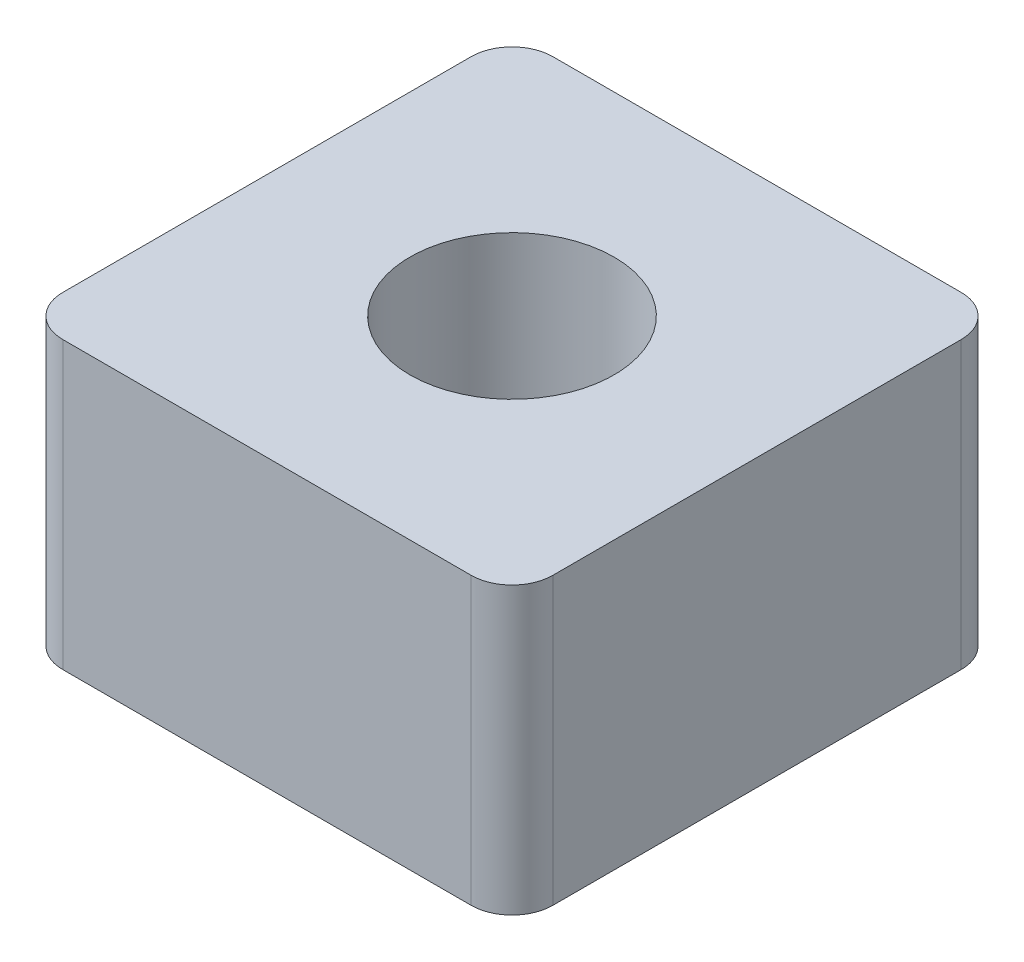
ISO-10303-21;
HEADER;
FILE_DESCRIPTION(('STEP AP214'),'2;1');
FILE_NAME('part.step','',(''),(''),'','','');
FILE_SCHEMA(('AUTOMOTIVE_DESIGN { 1 0 10303 214 1 1 1 1 }'));
ENDSEC;
DATA;
#1=APPLICATION_CONTEXT('core data for automotive mechanical design processes');
#2=APPLICATION_PROTOCOL_DEFINITION('international standard','automotive_design',2000,#1);
#3=PRODUCT_CONTEXT('',#1,'mechanical');
#4=PRODUCT('Part','Part','',(#3));
#5=PRODUCT_RELATED_PRODUCT_CATEGORY('part','',(#4));
#6=PRODUCT_DEFINITION_FORMATION('','',#4);
#7=PRODUCT_DEFINITION_CONTEXT('part definition',#1,'design');
#8=PRODUCT_DEFINITION('design','',#6,#7);
#9=PRODUCT_DEFINITION_SHAPE('','',#8);
#10=(LENGTH_UNIT() NAMED_UNIT(*) SI_UNIT(.MILLI.,.METRE.));
#11=(NAMED_UNIT(*) PLANE_ANGLE_UNIT() SI_UNIT($,.RADIAN.));
#12=(NAMED_UNIT(*) SI_UNIT($,.STERADIAN.) SOLID_ANGLE_UNIT());
#13=UNCERTAINTY_MEASURE_WITH_UNIT(LENGTH_MEASURE(1.E-05),#10,'distance_accuracy_value','');
#14=(GEOMETRIC_REPRESENTATION_CONTEXT(3) GLOBAL_UNCERTAINTY_ASSIGNED_CONTEXT((#13)) GLOBAL_UNIT_ASSIGNED_CONTEXT((#10,
#11,#12)) REPRESENTATION_CONTEXT('',''));
#15=CARTESIAN_POINT('',(0.,0.,0.));
#16=DIRECTION('',(0.,0.,1.));
#17=DIRECTION('',(1.,0.,0.));
#18=AXIS2_PLACEMENT_3D('',#15,#16,#17);
#19=CARTESIAN_POINT('',(-50.,70.,-50.));
#20=DIRECTION('',(0.,-1.,0.));
#21=DIRECTION('',(0.,0.,-1.));
#22=AXIS2_PLACEMENT_3D('',#19,#20,#21);
#23=CYLINDRICAL_SURFACE('',#22,10.);
#24=CARTESIAN_POINT('',(-50.,0.,-50.));
#25=DIRECTION('',(0.,-1.,0.));
#26=DIRECTION('',(0.,0.,-1.));
#27=AXIS2_PLACEMENT_3D('',#24,#25,#26);
#28=CIRCLE('',#27,10.);
#29=CARTESIAN_POINT('',(-60.,0.,-50.));
#30=VERTEX_POINT('',#29);
#31=CARTESIAN_POINT('',(-50.,0.,-60.));
#32=VERTEX_POINT('',#31);
#33=EDGE_CURVE('E131',#30,#32,#28,.T.);
#34=ORIENTED_EDGE('',*,*,#33,.F.);
#35=DIRECTION('',(0.,-1.,0.));
#36=VECTOR('',#35,1.);
#37=CARTESIAN_POINT('',(-60.,70.,-50.));
#38=LINE('',#37,#36);
#39=CARTESIAN_POINT('',(-60.,70.,-50.));
#40=VERTEX_POINT('',#39);
#41=EDGE_CURVE('E11',#40,#30,#38,.T.);
#42=ORIENTED_EDGE('',*,*,#41,.F.);
#43=CARTESIAN_POINT('',(-50.,70.,-50.));
#44=DIRECTION('',(0.,-1.,0.));
#45=DIRECTION('',(0.,0.,-1.));
#46=AXIS2_PLACEMENT_3D('',#43,#44,#45);
#47=CIRCLE('',#46,10.);
#48=CARTESIAN_POINT('',(-50.,70.,-60.));
#49=VERTEX_POINT('',#48);
#50=EDGE_CURVE('E150',#40,#49,#47,.T.);
#51=ORIENTED_EDGE('',*,*,#50,.T.);
#52=DIRECTION('',(0.,-1.,0.));
#53=VECTOR('',#52,1.);
#54=CARTESIAN_POINT('',(-50.,70.,-60.));
#55=LINE('',#54,#53);
#56=EDGE_CURVE('E40',#49,#32,#55,.T.);
#57=ORIENTED_EDGE('',*,*,#56,.T.);
#58=EDGE_LOOP('',(#34,#42,#51,#57));
#59=FACE_BOUND('',#58,.T.);
#60=ADVANCED_FACE('F37',(#59),#23,.T.);
#61=CARTESIAN_POINT('',(-60.,70.,50.));
#62=DIRECTION('',(-1.,0.,0.));
#63=DIRECTION('',(0.,0.,1.));
#64=AXIS2_PLACEMENT_3D('',#61,#62,#63);
#65=PLANE('',#64);
#66=DIRECTION('',(0.,0.,-1.));
#67=VECTOR('',#66,1.);
#68=CARTESIAN_POINT('',(-60.,0.,50.));
#69=LINE('',#68,#67);
#70=CARTESIAN_POINT('',(-60.,0.,50.));
#71=VERTEX_POINT('',#70);
#72=EDGE_CURVE('E148',#71,#30,#69,.T.);
#73=ORIENTED_EDGE('',*,*,#72,.F.);
#74=DIRECTION('',(0.,-1.,0.));
#75=VECTOR('',#74,1.);
#76=CARTESIAN_POINT('',(-60.,70.,50.));
#77=LINE('',#76,#75);
#78=CARTESIAN_POINT('',(-60.,70.,50.));
#79=VERTEX_POINT('',#78);
#80=EDGE_CURVE('E46',#79,#71,#77,.T.);
#81=ORIENTED_EDGE('',*,*,#80,.F.);
#82=DIRECTION('',(0.,0.,-1.));
#83=VECTOR('',#82,1.);
#84=CARTESIAN_POINT('',(-60.,70.,50.));
#85=LINE('',#84,#83);
#86=EDGE_CURVE('E126',#79,#40,#85,.T.);
#87=ORIENTED_EDGE('',*,*,#86,.T.);
#88=ORIENTED_EDGE('',*,*,#41,.T.);
#89=EDGE_LOOP('',(#73,#81,#87,#88));
#90=FACE_BOUND('',#89,.T.);
#91=ADVANCED_FACE('F165',(#90),#65,.T.);
#92=CARTESIAN_POINT('',(-50.,70.,50.));
#93=DIRECTION('',(0.,-1.,0.));
#94=DIRECTION('',(0.,0.,-1.));
#95=AXIS2_PLACEMENT_3D('',#92,#93,#94);
#96=CYLINDRICAL_SURFACE('',#95,10.);
#97=CARTESIAN_POINT('',(-50.,0.,50.));
#98=DIRECTION('',(0.,-1.,0.));
#99=DIRECTION('',(0.,0.,-1.));
#100=AXIS2_PLACEMENT_3D('',#97,#98,#99);
#101=CIRCLE('',#100,10.);
#102=CARTESIAN_POINT('',(-50.,0.,60.));
#103=VERTEX_POINT('',#102);
#104=EDGE_CURVE('E112',#103,#71,#101,.T.);
#105=ORIENTED_EDGE('',*,*,#104,.F.);
#106=DIRECTION('',(0.,-1.,0.));
#107=VECTOR('',#106,1.);
#108=CARTESIAN_POINT('',(-50.,70.,60.));
#109=LINE('',#108,#107);
#110=CARTESIAN_POINT('',(-50.,70.,60.));
#111=VERTEX_POINT('',#110);
#112=EDGE_CURVE('E106',#111,#103,#109,.T.);
#113=ORIENTED_EDGE('',*,*,#112,.F.);
#114=CARTESIAN_POINT('',(-50.,70.,50.));
#115=DIRECTION('',(0.,-1.,0.));
#116=DIRECTION('',(0.,0.,-1.));
#117=AXIS2_PLACEMENT_3D('',#114,#115,#116);
#118=CIRCLE('',#117,10.);
#119=EDGE_CURVE('E110',#111,#79,#118,.T.);
#120=ORIENTED_EDGE('',*,*,#119,.T.);
#121=ORIENTED_EDGE('',*,*,#80,.T.);
#122=EDGE_LOOP('',(#105,#113,#120,#121));
#123=FACE_BOUND('',#122,.T.);
#124=ADVANCED_FACE('F108',(#123),#96,.T.);
#125=CARTESIAN_POINT('',(-50.,70.,60.));
#126=DIRECTION('',(0.,0.,-1.));
#127=DIRECTION('',(-1.,0.,0.));
#128=AXIS2_PLACEMENT_3D('',#125,#126,#127);
#129=PLANE('',#128);
#130=DIRECTION('',(1.,0.,0.));
#131=VECTOR('',#130,1.);
#132=CARTESIAN_POINT('',(-50.,0.,60.));
#133=LINE('',#132,#131);
#134=CARTESIAN_POINT('',(50.,0.,60.));
#135=VERTEX_POINT('',#134);
#136=EDGE_CURVE('E145',#103,#135,#133,.T.);
#137=ORIENTED_EDGE('',*,*,#136,.T.);
#138=DIRECTION('',(0.,-1.,0.));
#139=VECTOR('',#138,1.);
#140=CARTESIAN_POINT('',(50.,70.,60.));
#141=LINE('',#140,#139);
#142=CARTESIAN_POINT('',(50.,70.,60.));
#143=VERTEX_POINT('',#142);
#144=EDGE_CURVE('E115',#143,#135,#141,.T.);
#145=ORIENTED_EDGE('',*,*,#144,.F.);
#146=DIRECTION('',(1.,0.,0.));
#147=VECTOR('',#146,1.);
#148=CARTESIAN_POINT('',(-50.,70.,60.));
#149=LINE('',#148,#147);
#150=EDGE_CURVE('E118',#111,#143,#149,.T.);
#151=ORIENTED_EDGE('',*,*,#150,.F.);
#152=ORIENTED_EDGE('',*,*,#112,.T.);
#153=EDGE_LOOP('',(#137,#145,#151,#152));
#154=FACE_BOUND('',#153,.T.);
#155=ADVANCED_FACE('F119',(#154),#129,.F.);
#156=CARTESIAN_POINT('',(50.,70.,50.));
#157=DIRECTION('',(0.,-1.,0.));
#158=DIRECTION('',(0.,0.,-1.));
#159=AXIS2_PLACEMENT_3D('',#156,#157,#158);
#160=CYLINDRICAL_SURFACE('',#159,10.);
#161=CARTESIAN_POINT('',(50.,0.,50.));
#162=DIRECTION('',(0.,1.,0.));
#163=DIRECTION('',(0.,0.,1.));
#164=AXIS2_PLACEMENT_3D('',#161,#162,#163);
#165=CIRCLE('',#164,10.);
#166=CARTESIAN_POINT('',(60.,0.,50.));
#167=VERTEX_POINT('',#166);
#168=EDGE_CURVE('E143',#135,#167,#165,.T.);
#169=ORIENTED_EDGE('',*,*,#168,.T.);
#170=DIRECTION('',(0.,-1.,0.));
#171=VECTOR('',#170,1.);
#172=CARTESIAN_POINT('',(60.,70.,50.));
#173=LINE('',#172,#171);
#174=CARTESIAN_POINT('',(60.,70.,50.));
#175=VERTEX_POINT('',#174);
#176=EDGE_CURVE('E154',#175,#167,#173,.T.);
#177=ORIENTED_EDGE('',*,*,#176,.F.);
#178=CARTESIAN_POINT('',(50.,70.,50.));
#179=DIRECTION('',(0.,1.,0.));
#180=DIRECTION('',(0.,0.,1.));
#181=AXIS2_PLACEMENT_3D('',#178,#179,#180);
#182=CIRCLE('',#181,10.);
#183=EDGE_CURVE('E123',#143,#175,#182,.T.);
#184=ORIENTED_EDGE('',*,*,#183,.F.);
#185=ORIENTED_EDGE('',*,*,#144,.T.);
#186=EDGE_LOOP('',(#169,#177,#184,#185));
#187=FACE_BOUND('',#186,.T.);
#188=ADVANCED_FACE('F178',(#187),#160,.T.);
#189=CARTESIAN_POINT('',(60.,70.,50.));
#190=DIRECTION('',(-1.,0.,0.));
#191=DIRECTION('',(0.,0.,1.));
#192=AXIS2_PLACEMENT_3D('',#189,#190,#191);
#193=PLANE('',#192);
#194=DIRECTION('',(0.,0.,-1.));
#195=VECTOR('',#194,1.);
#196=CARTESIAN_POINT('',(60.,0.,50.));
#197=LINE('',#196,#195);
#198=CARTESIAN_POINT('',(60.,0.,-50.));
#199=VERTEX_POINT('',#198);
#200=EDGE_CURVE('E141',#167,#199,#197,.T.);
#201=ORIENTED_EDGE('',*,*,#200,.T.);
#202=DIRECTION('',(0.,-1.,0.));
#203=VECTOR('',#202,1.);
#204=CARTESIAN_POINT('',(60.,70.,-50.));
#205=LINE('',#204,#203);
#206=CARTESIAN_POINT('',(60.,70.,-50.));
#207=VERTEX_POINT('',#206);
#208=EDGE_CURVE('E157',#207,#199,#205,.T.);
#209=ORIENTED_EDGE('',*,*,#208,.F.);
#210=DIRECTION('',(0.,0.,-1.));
#211=VECTOR('',#210,1.);
#212=CARTESIAN_POINT('',(60.,70.,50.));
#213=LINE('',#212,#211);
#214=EDGE_CURVE('E218',#175,#207,#213,.T.);
#215=ORIENTED_EDGE('',*,*,#214,.F.);
#216=ORIENTED_EDGE('',*,*,#176,.T.);
#217=EDGE_LOOP('',(#201,#209,#215,#216));
#218=FACE_BOUND('',#217,.T.);
#219=ADVANCED_FACE('F181',(#218),#193,.F.);
#220=CARTESIAN_POINT('',(50.,70.,-50.));
#221=DIRECTION('',(0.,-1.,0.));
#222=DIRECTION('',(0.,0.,-1.));
#223=AXIS2_PLACEMENT_3D('',#220,#221,#222);
#224=CYLINDRICAL_SURFACE('',#223,10.);
#225=CARTESIAN_POINT('',(50.,0.,-50.));
#226=DIRECTION('',(0.,1.,0.));
#227=DIRECTION('',(0.,0.,1.));
#228=AXIS2_PLACEMENT_3D('',#225,#226,#227);
#229=CIRCLE('',#228,10.);
#230=CARTESIAN_POINT('',(50.,0.,-60.));
#231=VERTEX_POINT('',#230);
#232=EDGE_CURVE('E138',#199,#231,#229,.T.);
#233=ORIENTED_EDGE('',*,*,#232,.T.);
#234=DIRECTION('',(0.,-1.,0.));
#235=VECTOR('',#234,1.);
#236=CARTESIAN_POINT('',(50.,70.,-60.));
#237=LINE('',#236,#235);
#238=CARTESIAN_POINT('',(50.,70.,-60.));
#239=VERTEX_POINT('',#238);
#240=EDGE_CURVE('E159',#239,#231,#237,.T.);
#241=ORIENTED_EDGE('',*,*,#240,.F.);
#242=CARTESIAN_POINT('',(50.,70.,-50.));
#243=DIRECTION('',(0.,1.,0.));
#244=DIRECTION('',(0.,0.,1.));
#245=AXIS2_PLACEMENT_3D('',#242,#243,#244);
#246=CIRCLE('',#245,10.);
#247=EDGE_CURVE('E216',#207,#239,#246,.T.);
#248=ORIENTED_EDGE('',*,*,#247,.F.);
#249=ORIENTED_EDGE('',*,*,#208,.T.);
#250=EDGE_LOOP('',(#233,#241,#248,#249));
#251=FACE_BOUND('',#250,.T.);
#252=ADVANCED_FACE('F185',(#251),#224,.T.);
#253=CARTESIAN_POINT('',(-50.,70.,-60.));
#254=DIRECTION('',(0.,0.,-1.));
#255=DIRECTION('',(-1.,0.,0.));
#256=AXIS2_PLACEMENT_3D('',#253,#254,#255);
#257=PLANE('',#256);
#258=DIRECTION('',(1.,0.,0.));
#259=VECTOR('',#258,1.);
#260=CARTESIAN_POINT('',(-50.,0.,-60.));
#261=LINE('',#260,#259);
#262=EDGE_CURVE('E134',#32,#231,#261,.T.);
#263=ORIENTED_EDGE('',*,*,#262,.F.);
#264=ORIENTED_EDGE('',*,*,#56,.F.);
#265=DIRECTION('',(1.,0.,0.));
#266=VECTOR('',#265,1.);
#267=CARTESIAN_POINT('',(-50.,70.,-60.));
#268=LINE('',#267,#266);
#269=EDGE_CURVE('E214',#49,#239,#268,.T.);
#270=ORIENTED_EDGE('',*,*,#269,.T.);
#271=ORIENTED_EDGE('',*,*,#240,.T.);
#272=EDGE_LOOP('',(#263,#264,#270,#271));
#273=FACE_BOUND('',#272,.T.);
#274=ADVANCED_FACE('F161',(#273),#257,.T.);
#275=CARTESIAN_POINT('',(-50.,70.,-50.));
#276=DIRECTION('',(0.,-1.,0.));
#277=DIRECTION('',(0.,0.,-1.));
#278=AXIS2_PLACEMENT_3D('',#275,#276,#277);
#279=PLANE('',#278);
#280=CARTESIAN_POINT('',(0.,70.,0.));
#281=DIRECTION('',(0.,-1.,0.));
#282=DIRECTION('',(0.,0.,-1.));
#283=AXIS2_PLACEMENT_3D('',#280,#281,#282);
#284=CIRCLE('',#283,25.);
#285=CARTESIAN_POINT('',(0.,70.,-25.));
#286=VERTEX_POINT('',#285);
#287=EDGE_CURVE('E135',#286,#286,#284,.T.);
#288=ORIENTED_EDGE('',*,*,#287,.T.);
#289=EDGE_LOOP('',(#288));
#290=FACE_BOUND('',#289,.T.);
#291=ORIENTED_EDGE('',*,*,#50,.F.);
#292=ORIENTED_EDGE('',*,*,#86,.F.);
#293=ORIENTED_EDGE('',*,*,#119,.F.);
#294=ORIENTED_EDGE('',*,*,#150,.T.);
#295=ORIENTED_EDGE('',*,*,#183,.T.);
#296=ORIENTED_EDGE('',*,*,#214,.T.);
#297=ORIENTED_EDGE('',*,*,#247,.T.);
#298=ORIENTED_EDGE('',*,*,#269,.F.);
#299=EDGE_LOOP('',(#291,#292,#293,#294,#295,#296,#297,#298));
#300=FACE_BOUND('',#299,.T.);
#301=ADVANCED_FACE('F125',(#290,#300),#279,.F.);
#302=CARTESIAN_POINT('',(-50.,0.,-50.));
#303=DIRECTION('',(0.,-1.,0.));
#304=DIRECTION('',(0.,0.,-1.));
#305=AXIS2_PLACEMENT_3D('',#302,#303,#304);
#306=PLANE('',#305);
#307=CARTESIAN_POINT('',(0.,0.,0.));
#308=DIRECTION('',(0.,-1.,0.));
#309=DIRECTION('',(0.,0.,-1.));
#310=AXIS2_PLACEMENT_3D('',#307,#308,#309);
#311=CIRCLE('',#310,25.);
#312=CARTESIAN_POINT('',(0.,0.,-25.));
#313=VERTEX_POINT('',#312);
#314=EDGE_CURVE('E209',#313,#313,#311,.T.);
#315=ORIENTED_EDGE('',*,*,#314,.F.);
#316=EDGE_LOOP('',(#315));
#317=FACE_BOUND('',#316,.T.);
#318=ORIENTED_EDGE('',*,*,#33,.T.);
#319=ORIENTED_EDGE('',*,*,#262,.T.);
#320=ORIENTED_EDGE('',*,*,#232,.F.);
#321=ORIENTED_EDGE('',*,*,#200,.F.);
#322=ORIENTED_EDGE('',*,*,#168,.F.);
#323=ORIENTED_EDGE('',*,*,#136,.F.);
#324=ORIENTED_EDGE('',*,*,#104,.T.);
#325=ORIENTED_EDGE('',*,*,#72,.T.);
#326=EDGE_LOOP('',(#318,#319,#320,#321,#322,#323,#324,#325));
#327=FACE_BOUND('',#326,.T.);
#328=ADVANCED_FACE('F164',(#317,#327),#306,.T.);
#329=CARTESIAN_POINT('',(0.,70.,0.));
#330=DIRECTION('',(0.,-1.,0.));
#331=DIRECTION('',(0.,0.,-1.));
#332=AXIS2_PLACEMENT_3D('',#329,#330,#331);
#333=CYLINDRICAL_SURFACE('',#332,25.);
#334=ORIENTED_EDGE('',*,*,#287,.F.);
#335=EDGE_LOOP('',(#334));
#336=FACE_BOUND('',#335,.T.);
#337=ORIENTED_EDGE('',*,*,#314,.T.);
#338=EDGE_LOOP('',(#337));
#339=FACE_BOUND('',#338,.T.);
#340=ADVANCED_FACE('F197',(#336,#339),#333,.F.);
#341=CLOSED_SHELL('',(#60,#91,#124,#155,#188,#219,#252,#274,#301,#328,#340));
#342=MANIFOLD_SOLID_BREP('B2',#341);
#343=ADVANCED_BREP_SHAPE_REPRESENTATION('',(#18,#342),#14);
#344=SHAPE_DEFINITION_REPRESENTATION(#9,#343);
ENDSEC;
END-ISO-10303-21;
